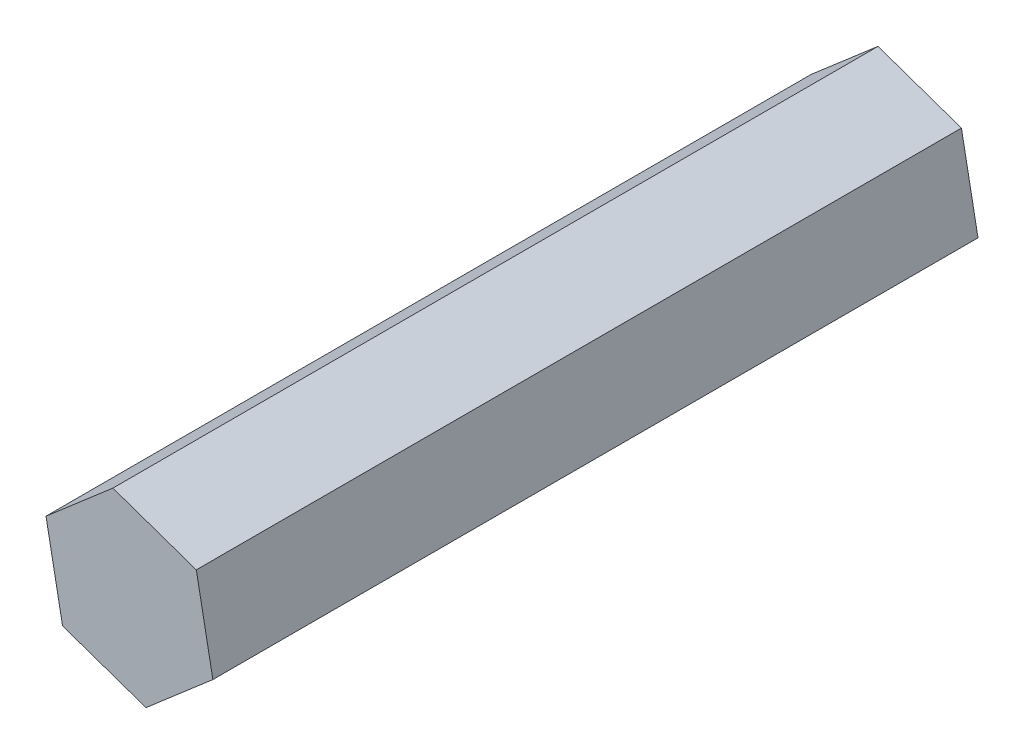
ISO-10303-21;
HEADER;
FILE_DESCRIPTION(('STEP AP214'),'2;1');
FILE_NAME('part.step','',(''),(''),'','','');
FILE_SCHEMA(('AUTOMOTIVE_DESIGN { 1 0 10303 214 1 1 1 1 }'));
ENDSEC;
DATA;
#1=APPLICATION_CONTEXT('core data for automotive mechanical design processes');
#2=APPLICATION_PROTOCOL_DEFINITION('international standard','automotive_design',2000,#1);
#3=PRODUCT_CONTEXT('',#1,'mechanical');
#4=PRODUCT('Part','Part','',(#3));
#5=PRODUCT_RELATED_PRODUCT_CATEGORY('part','',(#4));
#6=PRODUCT_DEFINITION_FORMATION('','',#4);
#7=PRODUCT_DEFINITION_CONTEXT('part definition',#1,'design');
#8=PRODUCT_DEFINITION('design','',#6,#7);
#9=PRODUCT_DEFINITION_SHAPE('','',#8);
#10=(LENGTH_UNIT() NAMED_UNIT(*) SI_UNIT(.MILLI.,.METRE.));
#11=(NAMED_UNIT(*) PLANE_ANGLE_UNIT() SI_UNIT($,.RADIAN.));
#12=(NAMED_UNIT(*) SI_UNIT($,.STERADIAN.) SOLID_ANGLE_UNIT());
#13=UNCERTAINTY_MEASURE_WITH_UNIT(LENGTH_MEASURE(1.E-05),#10,'distance_accuracy_value','');
#14=(GEOMETRIC_REPRESENTATION_CONTEXT(3) GLOBAL_UNCERTAINTY_ASSIGNED_CONTEXT((#13)) GLOBAL_UNIT_ASSIGNED_CONTEXT((#10,
#11,#12)) REPRESENTATION_CONTEXT('',''));
#15=CARTESIAN_POINT('',(0.,0.,0.));
#16=DIRECTION('',(0.,0.,1.));
#17=DIRECTION('',(1.,0.,0.));
#18=AXIS2_PLACEMENT_3D('',#15,#16,#17);
#19=CARTESIAN_POINT('',(6.92467965320127,-2.41083907257902,63.5));
#20=DIRECTION('',(-0.982273020558382,-0.187455896367952,0.));
#21=DIRECTION('',(0.187455896367952,-0.982273020558382,0.));
#22=AXIS2_PLACEMENT_3D('',#19,#20,#21);
#23=PLANE('',#22);
#24=DIRECTION('',(-0.187455896367952,0.982273020558382,0.));
#25=VECTOR('',#24,1.);
#26=CARTESIAN_POINT('',(6.92467965320127,-2.41083907257902,0.));
#27=LINE('',#26,#25);
#28=CARTESIAN_POINT('',(6.92467965320127,-2.41083907257902,0.));
#29=VERTEX_POINT('',#28);
#30=CARTESIAN_POINT('',(5.55018770789018,4.79152895645201,0.));
#31=VERTEX_POINT('',#30);
#32=EDGE_CURVE('E117',#29,#31,#27,.T.);
#33=ORIENTED_EDGE('',*,*,#32,.T.);
#34=DIRECTION('',(0.,0.,-1.));
#35=VECTOR('',#34,1.);
#36=CARTESIAN_POINT('',(5.55018770789018,4.79152895645201,63.5));
#37=LINE('',#36,#35);
#38=CARTESIAN_POINT('',(5.55018770789018,4.79152895645201,63.5));
#39=VERTEX_POINT('',#38);
#40=EDGE_CURVE('E11',#39,#31,#37,.T.);
#41=ORIENTED_EDGE('',*,*,#40,.F.);
#42=DIRECTION('',(-0.187455896367952,0.982273020558382,0.));
#43=VECTOR('',#42,1.);
#44=CARTESIAN_POINT('',(6.92467965320127,-2.41083907257902,63.5));
#45=LINE('',#44,#43);
#46=CARTESIAN_POINT('',(6.92467965320127,-2.41083907257902,63.5));
#47=VERTEX_POINT('',#46);
#48=EDGE_CURVE('E127',#47,#39,#45,.T.);
#49=ORIENTED_EDGE('',*,*,#48,.F.);
#50=DIRECTION('',(0.,0.,-1.));
#51=VECTOR('',#50,1.);
#52=CARTESIAN_POINT('',(6.92467965320127,-2.41083907257902,63.5));
#53=LINE('',#52,#51);
#54=EDGE_CURVE('E113',#47,#29,#53,.T.);
#55=ORIENTED_EDGE('',*,*,#54,.T.);
#56=EDGE_LOOP('',(#33,#41,#49,#55));
#57=FACE_BOUND('',#56,.T.);
#58=ADVANCED_FACE('F33',(#57),#23,.F.);
#59=CARTESIAN_POINT('',(5.55018770789018,4.79152895645201,63.5));
#60=DIRECTION('',(-0.328794941935362,-0.944401337439609,0.));
#61=DIRECTION('',(0.944401337439609,-0.328794941935362,0.));
#62=AXIS2_PLACEMENT_3D('',#59,#60,#61);
#63=PLANE('',#62);
#64=DIRECTION('',(-0.944401337439609,0.328794941935362,0.));
#65=VECTOR('',#64,1.);
#66=CARTESIAN_POINT('',(5.55018770789018,4.79152895645201,0.));
#67=LINE('',#66,#65);
#68=CARTESIAN_POINT('',(-1.37449194531109,7.20236802903103,0.));
#69=VERTEX_POINT('',#68);
#70=EDGE_CURVE('E120',#31,#69,#67,.T.);
#71=ORIENTED_EDGE('',*,*,#70,.T.);
#72=DIRECTION('',(0.,0.,-1.));
#73=VECTOR('',#72,1.);
#74=CARTESIAN_POINT('',(-1.37449194531109,7.20236802903103,63.5));
#75=LINE('',#74,#73);
#76=CARTESIAN_POINT('',(-1.37449194531109,7.20236802903103,63.5));
#77=VERTEX_POINT('',#76);
#78=EDGE_CURVE('E41',#77,#69,#75,.T.);
#79=ORIENTED_EDGE('',*,*,#78,.F.);
#80=DIRECTION('',(-0.944401337439609,0.328794941935362,0.));
#81=VECTOR('',#80,1.);
#82=CARTESIAN_POINT('',(5.55018770789018,4.79152895645201,63.5));
#83=LINE('',#82,#81);
#84=EDGE_CURVE('E86',#39,#77,#83,.T.);
#85=ORIENTED_EDGE('',*,*,#84,.F.);
#86=ORIENTED_EDGE('',*,*,#40,.T.);
#87=EDGE_LOOP('',(#71,#79,#85,#86));
#88=FACE_BOUND('',#87,.T.);
#89=ADVANCED_FACE('F151',(#88),#63,.F.);
#90=CARTESIAN_POINT('',(-1.37449194531109,7.20236802903103,63.5));
#91=DIRECTION('',(0.653478078623021,-0.756945441071657,0.));
#92=DIRECTION('',(0.756945441071657,0.653478078623021,0.));
#93=AXIS2_PLACEMENT_3D('',#90,#91,#92);
#94=PLANE('',#93);
#95=DIRECTION('',(-0.756945441071657,-0.653478078623021,0.));
#96=VECTOR('',#95,1.);
#97=CARTESIAN_POINT('',(-1.37449194531109,7.20236802903103,0.));
#98=LINE('',#97,#96);
#99=CARTESIAN_POINT('',(-6.92467965320127,2.41083907257901,0.));
#100=VERTEX_POINT('',#99);
#101=EDGE_CURVE('E122',#69,#100,#98,.T.);
#102=ORIENTED_EDGE('',*,*,#101,.T.);
#103=DIRECTION('',(0.,0.,-1.));
#104=VECTOR('',#103,1.);
#105=CARTESIAN_POINT('',(-6.92467965320127,2.41083907257901,63.5));
#106=LINE('',#105,#104);
#107=CARTESIAN_POINT('',(-6.92467965320127,2.41083907257901,63.5));
#108=VERTEX_POINT('',#107);
#109=EDGE_CURVE('E108',#108,#100,#106,.T.);
#110=ORIENTED_EDGE('',*,*,#109,.F.);
#111=DIRECTION('',(-0.756945441071657,-0.653478078623021,0.));
#112=VECTOR('',#111,1.);
#113=CARTESIAN_POINT('',(-1.37449194531109,7.20236802903103,63.5));
#114=LINE('',#113,#112);
#115=EDGE_CURVE('E99',#77,#108,#114,.T.);
#116=ORIENTED_EDGE('',*,*,#115,.F.);
#117=ORIENTED_EDGE('',*,*,#78,.T.);
#118=EDGE_LOOP('',(#102,#110,#116,#117));
#119=FACE_BOUND('',#118,.T.);
#120=ADVANCED_FACE('F133',(#119),#94,.F.);
#121=CARTESIAN_POINT('',(-6.92467965320127,2.41083907257901,63.5));
#122=DIRECTION('',(0.982273020558382,0.187455896367953,0.));
#123=DIRECTION('',(-0.187455896367953,0.982273020558382,0.));
#124=AXIS2_PLACEMENT_3D('',#121,#122,#123);
#125=PLANE('',#124);
#126=DIRECTION('',(0.187455896367952,-0.982273020558382,0.));
#127=VECTOR('',#126,1.);
#128=CARTESIAN_POINT('',(-6.92467965320127,2.41083907257901,0.));
#129=LINE('',#128,#127);
#130=CARTESIAN_POINT('',(-5.55018770789018,-4.79152895645201,0.));
#131=VERTEX_POINT('',#130);
#132=EDGE_CURVE('E107',#100,#131,#129,.T.);
#133=ORIENTED_EDGE('',*,*,#132,.T.);
#134=DIRECTION('',(0.,0.,-1.));
#135=VECTOR('',#134,1.);
#136=CARTESIAN_POINT('',(-5.55018770789018,-4.79152895645201,63.5));
#137=LINE('',#136,#135);
#138=CARTESIAN_POINT('',(-5.55018770789018,-4.79152895645201,63.5));
#139=VERTEX_POINT('',#138);
#140=EDGE_CURVE('E104',#139,#131,#137,.T.);
#141=ORIENTED_EDGE('',*,*,#140,.F.);
#142=DIRECTION('',(0.187455896367952,-0.982273020558382,0.));
#143=VECTOR('',#142,1.);
#144=CARTESIAN_POINT('',(-6.92467965320127,2.41083907257901,63.5));
#145=LINE('',#144,#143);
#146=EDGE_CURVE('E93',#108,#139,#145,.T.);
#147=ORIENTED_EDGE('',*,*,#146,.F.);
#148=ORIENTED_EDGE('',*,*,#109,.T.);
#149=EDGE_LOOP('',(#133,#141,#147,#148));
#150=FACE_BOUND('',#149,.T.);
#151=ADVANCED_FACE('F105',(#150),#125,.F.);
#152=CARTESIAN_POINT('',(-5.55018770789018,-4.79152895645201,63.5));
#153=DIRECTION('',(0.328794941935361,0.944401337439609,0.));
#154=DIRECTION('',(-0.944401337439609,0.328794941935361,0.));
#155=AXIS2_PLACEMENT_3D('',#152,#153,#154);
#156=PLANE('',#155);
#157=DIRECTION('',(0.944401337439609,-0.328794941935361,0.));
#158=VECTOR('',#157,1.);
#159=CARTESIAN_POINT('',(-5.55018770789018,-4.79152895645201,0.));
#160=LINE('',#159,#158);
#161=CARTESIAN_POINT('',(1.37449194531109,-7.20236802903103,0.));
#162=VERTEX_POINT('',#161);
#163=EDGE_CURVE('E72',#131,#162,#160,.T.);
#164=ORIENTED_EDGE('',*,*,#163,.T.);
#165=DIRECTION('',(0.,0.,-1.));
#166=VECTOR('',#165,1.);
#167=CARTESIAN_POINT('',(1.37449194531109,-7.20236802903103,63.5));
#168=LINE('',#167,#166);
#169=CARTESIAN_POINT('',(1.37449194531109,-7.20236802903103,63.5));
#170=VERTEX_POINT('',#169);
#171=EDGE_CURVE('E109',#170,#162,#168,.T.);
#172=ORIENTED_EDGE('',*,*,#171,.F.);
#173=DIRECTION('',(0.944401337439609,-0.328794941935361,0.));
#174=VECTOR('',#173,1.);
#175=CARTESIAN_POINT('',(-5.55018770789018,-4.79152895645201,63.5));
#176=LINE('',#175,#174);
#177=EDGE_CURVE('E97',#139,#170,#176,.T.);
#178=ORIENTED_EDGE('',*,*,#177,.F.);
#179=ORIENTED_EDGE('',*,*,#140,.T.);
#180=EDGE_LOOP('',(#164,#172,#178,#179));
#181=FACE_BOUND('',#180,.T.);
#182=ADVANCED_FACE('F111',(#181),#156,.F.);
#183=CARTESIAN_POINT('',(1.37449194531109,-7.20236802903103,63.5));
#184=DIRECTION('',(-0.653478078623021,0.756945441071657,0.));
#185=DIRECTION('',(-0.756945441071657,-0.653478078623021,0.));
#186=AXIS2_PLACEMENT_3D('',#183,#184,#185);
#187=PLANE('',#186);
#188=DIRECTION('',(0.756945441071657,0.653478078623021,0.));
#189=VECTOR('',#188,1.);
#190=CARTESIAN_POINT('',(1.37449194531109,-7.20236802903103,0.));
#191=LINE('',#190,#189);
#192=EDGE_CURVE('E78',#162,#29,#191,.T.);
#193=ORIENTED_EDGE('',*,*,#192,.T.);
#194=ORIENTED_EDGE('',*,*,#54,.F.);
#195=DIRECTION('',(0.756945441071657,0.653478078623021,0.));
#196=VECTOR('',#195,1.);
#197=CARTESIAN_POINT('',(1.37449194531109,-7.20236802903103,63.5));
#198=LINE('',#197,#196);
#199=EDGE_CURVE('E49',#170,#47,#198,.T.);
#200=ORIENTED_EDGE('',*,*,#199,.F.);
#201=ORIENTED_EDGE('',*,*,#171,.T.);
#202=EDGE_LOOP('',(#193,#194,#200,#201));
#203=FACE_BOUND('',#202,.T.);
#204=ADVANCED_FACE('F140',(#203),#187,.F.);
#205=CARTESIAN_POINT('',(0.,0.,63.5));
#206=DIRECTION('',(0.,0.,1.));
#207=DIRECTION('',(1.,0.,0.));
#208=AXIS2_PLACEMENT_3D('',#205,#206,#207);
#209=PLANE('',#208);
#210=ORIENTED_EDGE('',*,*,#48,.T.);
#211=ORIENTED_EDGE('',*,*,#84,.T.);
#212=ORIENTED_EDGE('',*,*,#115,.T.);
#213=ORIENTED_EDGE('',*,*,#146,.T.);
#214=ORIENTED_EDGE('',*,*,#177,.T.);
#215=ORIENTED_EDGE('',*,*,#199,.T.);
#216=EDGE_LOOP('',(#210,#211,#212,#213,#214,#215));
#217=FACE_BOUND('',#216,.T.);
#218=ADVANCED_FACE('F95',(#217),#209,.T.);
#219=CARTESIAN_POINT('',(0.,0.,0.));
#220=DIRECTION('',(0.,0.,1.));
#221=DIRECTION('',(1.,0.,0.));
#222=AXIS2_PLACEMENT_3D('',#219,#220,#221);
#223=PLANE('',#222);
#224=ORIENTED_EDGE('',*,*,#32,.F.);
#225=ORIENTED_EDGE('',*,*,#192,.F.);
#226=ORIENTED_EDGE('',*,*,#163,.F.);
#227=ORIENTED_EDGE('',*,*,#132,.F.);
#228=ORIENTED_EDGE('',*,*,#101,.F.);
#229=ORIENTED_EDGE('',*,*,#70,.F.);
#230=EDGE_LOOP('',(#224,#225,#226,#227,#228,#229));
#231=FACE_BOUND('',#230,.T.);
#232=ADVANCED_FACE('F136',(#231),#223,.F.);
#233=CLOSED_SHELL('',(#58,#89,#120,#151,#182,#204,#218,#232));
#234=MANIFOLD_SOLID_BREP('B2',#233);
#235=ADVANCED_BREP_SHAPE_REPRESENTATION('',(#18,#234),#14);
#236=SHAPE_DEFINITION_REPRESENTATION(#9,#235);
ENDSEC;
END-ISO-10303-21;
